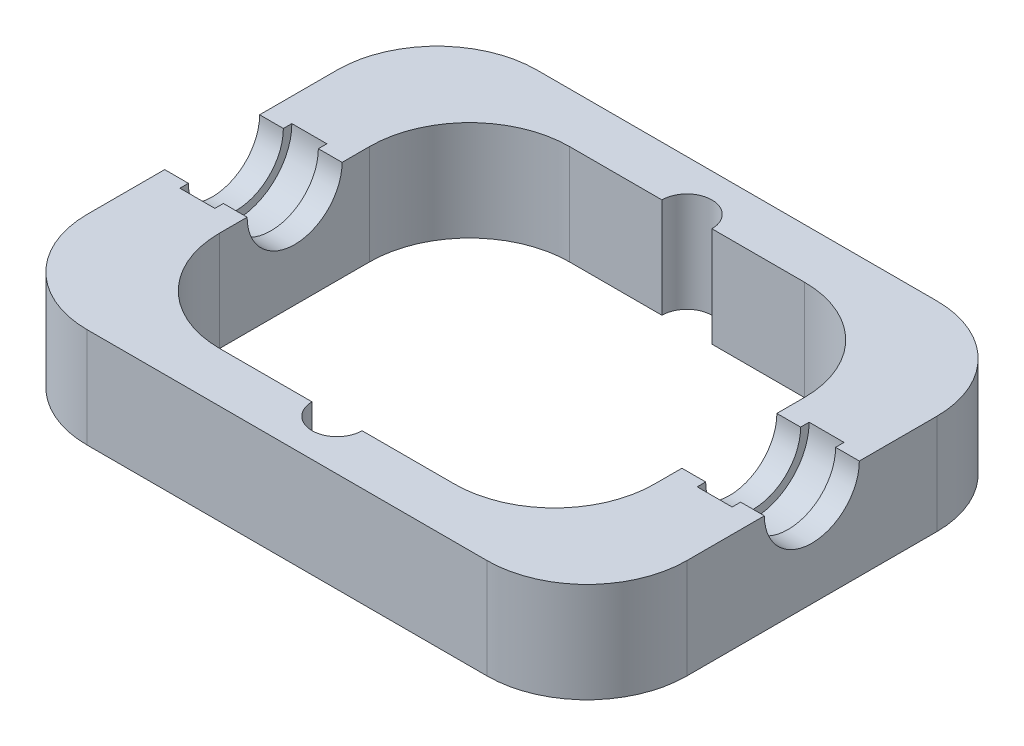
ISO-10303-21;
HEADER;
FILE_DESCRIPTION(('STEP AP214'),'2;1');
FILE_NAME('part.step','',(''),(''),'','','');
FILE_SCHEMA(('AUTOMOTIVE_DESIGN { 1 0 10303 214 1 1 1 1 }'));
ENDSEC;
DATA;
#1=APPLICATION_CONTEXT('core data for automotive mechanical design processes');
#2=APPLICATION_PROTOCOL_DEFINITION('international standard','automotive_design',2000,#1);
#3=PRODUCT_CONTEXT('',#1,'mechanical');
#4=PRODUCT('Part','Part','',(#3));
#5=PRODUCT_RELATED_PRODUCT_CATEGORY('part','',(#4));
#6=PRODUCT_DEFINITION_FORMATION('','',#4);
#7=PRODUCT_DEFINITION_CONTEXT('part definition',#1,'design');
#8=PRODUCT_DEFINITION('design','',#6,#7);
#9=PRODUCT_DEFINITION_SHAPE('','',#8);
#10=(LENGTH_UNIT() NAMED_UNIT(*) SI_UNIT(.MILLI.,.METRE.));
#11=(NAMED_UNIT(*) PLANE_ANGLE_UNIT() SI_UNIT($,.RADIAN.));
#12=(NAMED_UNIT(*) SI_UNIT($,.STERADIAN.) SOLID_ANGLE_UNIT());
#13=UNCERTAINTY_MEASURE_WITH_UNIT(LENGTH_MEASURE(1.E-05),#10,'distance_accuracy_value','');
#14=(GEOMETRIC_REPRESENTATION_CONTEXT(3) GLOBAL_UNCERTAINTY_ASSIGNED_CONTEXT((#13)) GLOBAL_UNIT_ASSIGNED_CONTEXT((#10,
#11,#12)) REPRESENTATION_CONTEXT('',''));
#15=CARTESIAN_POINT('',(0.,0.,0.));
#16=DIRECTION('',(0.,0.,1.));
#17=DIRECTION('',(1.,0.,0.));
#18=AXIS2_PLACEMENT_3D('',#15,#16,#17);
#19=CARTESIAN_POINT('',(43.5,20.,-35.));
#20=DIRECTION('',(0.,0.,1.));
#21=DIRECTION('',(1.,0.,0.));
#22=AXIS2_PLACEMENT_3D('',#19,#20,#21);
#23=PLANE('',#22);
#24=DIRECTION('',(0.,1.,0.));
#25=VECTOR('',#24,1.);
#26=CARTESIAN_POINT('',(4.99999999999999,0.,-35.));
#27=LINE('',#26,#25);
#28=CARTESIAN_POINT('',(4.99999999999999,0.,-35.));
#29=VERTEX_POINT('',#28);
#30=CARTESIAN_POINT('',(4.99999999999999,20.,-35.));
#31=VERTEX_POINT('',#30);
#32=EDGE_CURVE('E11',#29,#31,#27,.T.);
#33=ORIENTED_EDGE('',*,*,#32,.F.);
#34=DIRECTION('',(-1.,0.,0.));
#35=VECTOR('',#34,1.);
#36=CARTESIAN_POINT('',(43.5,0.,-35.));
#37=LINE('',#36,#35);
#38=CARTESIAN_POINT('',(23.5,0.,-35.));
#39=VERTEX_POINT('',#38);
#40=EDGE_CURVE('E280',#39,#29,#37,.T.);
#41=ORIENTED_EDGE('',*,*,#40,.F.);
#42=DIRECTION('',(0.,-1.,0.));
#43=VECTOR('',#42,1.);
#44=CARTESIAN_POINT('',(23.5,20.,-35.));
#45=LINE('',#44,#43);
#46=CARTESIAN_POINT('',(23.5,20.,-35.));
#47=VERTEX_POINT('',#46);
#48=EDGE_CURVE('E258',#39,#47,#45,.F.);
#49=ORIENTED_EDGE('',*,*,#48,.T.);
#50=DIRECTION('',(-1.,0.,0.));
#51=VECTOR('',#50,1.);
#52=CARTESIAN_POINT('',(43.5,20.,-35.));
#53=LINE('',#52,#51);
#54=EDGE_CURVE('E252',#47,#31,#53,.T.);
#55=ORIENTED_EDGE('',*,*,#54,.T.);
#56=EDGE_LOOP('',(#33,#41,#49,#55));
#57=FACE_BOUND('',#56,.T.);
#58=ADVANCED_FACE('F35',(#57),#23,.T.);
#59=CARTESIAN_POINT('',(43.5,20.,35.));
#60=DIRECTION('',(0.,0.,-1.));
#61=DIRECTION('',(-1.,0.,0.));
#62=AXIS2_PLACEMENT_3D('',#59,#60,#61);
#63=PLANE('',#62);
#64=DIRECTION('',(0.,1.,0.));
#65=VECTOR('',#64,1.);
#66=CARTESIAN_POINT('',(-5.00000000000001,0.,35.));
#67=LINE('',#66,#65);
#68=CARTESIAN_POINT('',(-5.00000000000001,0.,35.));
#69=VERTEX_POINT('',#68);
#70=CARTESIAN_POINT('',(-5.00000000000001,20.,35.));
#71=VERTEX_POINT('',#70);
#72=EDGE_CURVE('E406',#69,#71,#67,.T.);
#73=ORIENTED_EDGE('',*,*,#72,.F.);
#74=DIRECTION('',(1.,0.,0.));
#75=VECTOR('',#74,1.);
#76=CARTESIAN_POINT('',(43.5,0.,35.));
#77=LINE('',#76,#75);
#78=CARTESIAN_POINT('',(-23.5,0.,35.));
#79=VERTEX_POINT('',#78);
#80=EDGE_CURVE('E273',#79,#69,#77,.T.);
#81=ORIENTED_EDGE('',*,*,#80,.F.);
#82=DIRECTION('',(0.,-1.,0.));
#83=VECTOR('',#82,1.);
#84=CARTESIAN_POINT('',(-23.5,20.,35.));
#85=LINE('',#84,#83);
#86=CARTESIAN_POINT('',(-23.5,20.,35.));
#87=VERTEX_POINT('',#86);
#88=EDGE_CURVE('E377',#79,#87,#85,.F.);
#89=ORIENTED_EDGE('',*,*,#88,.T.);
#90=DIRECTION('',(1.,0.,0.));
#91=VECTOR('',#90,1.);
#92=CARTESIAN_POINT('',(43.5,20.,35.));
#93=LINE('',#92,#91);
#94=EDGE_CURVE('E437',#87,#71,#93,.T.);
#95=ORIENTED_EDGE('',*,*,#94,.T.);
#96=EDGE_LOOP('',(#73,#81,#89,#95));
#97=FACE_BOUND('',#96,.T.);
#98=ADVANCED_FACE('F434',(#97),#63,.T.);
#99=CARTESIAN_POINT('',(0.,20.,0.));
#100=DIRECTION('',(0.,1.,0.));
#101=DIRECTION('',(0.,0.,1.));
#102=AXIS2_PLACEMENT_3D('',#99,#100,#101);
#103=PLANE('',#102);
#104=CARTESIAN_POINT('',(0.,20.,35.));
#105=DIRECTION('',(0.,1.,0.));
#106=DIRECTION('',(0.,0.,1.));
#107=AXIS2_PLACEMENT_3D('',#104,#105,#106);
#108=CIRCLE('',#107,5.);
#109=CARTESIAN_POINT('',(4.99999999999998,20.,35.));
#110=VERTEX_POINT('',#109);
#111=EDGE_CURVE('E57',#71,#110,#108,.T.);
#112=ORIENTED_EDGE('',*,*,#111,.F.);
#113=ORIENTED_EDGE('',*,*,#94,.F.);
#114=CARTESIAN_POINT('',(-23.5,20.,15.));
#115=DIRECTION('',(0.,1.,0.));
#116=DIRECTION('',(0.,0.,1.));
#117=AXIS2_PLACEMENT_3D('',#114,#115,#116);
#118=CIRCLE('',#117,20.);
#119=CARTESIAN_POINT('',(-43.5,20.,15.));
#120=VERTEX_POINT('',#119);
#121=EDGE_CURVE('E398',#87,#120,#118,.F.);
#122=ORIENTED_EDGE('',*,*,#121,.T.);
#123=DIRECTION('',(0.,0.,1.));
#124=VECTOR('',#123,1.);
#125=CARTESIAN_POINT('',(-43.5,20.,35.));
#126=LINE('',#125,#124);
#127=CARTESIAN_POINT('',(-43.5,20.,9.50000000000002));
#128=VERTEX_POINT('',#127);
#129=EDGE_CURVE('E282',#128,#120,#126,.T.);
#130=ORIENTED_EDGE('',*,*,#129,.F.);
#131=DIRECTION('',(1.,0.,0.));
#132=VECTOR('',#131,1.);
#133=CARTESIAN_POINT('',(-60.,20.,9.50000000000002));
#134=LINE('',#133,#132);
#135=CARTESIAN_POINT('',(-48.25,20.,9.50000000000002));
#136=VERTEX_POINT('',#135);
#137=EDGE_CURVE('E475',#136,#128,#134,.T.);
#138=ORIENTED_EDGE('',*,*,#137,.F.);
#139=DIRECTION('',(0.,0.,-1.));
#140=VECTOR('',#139,1.);
#141=CARTESIAN_POINT('',(-48.25,20.,0.));
#142=LINE('',#141,#140);
#143=CARTESIAN_POINT('',(-48.25,20.,11.2));
#144=VERTEX_POINT('',#143);
#145=EDGE_CURVE('E304',#144,#136,#142,.T.);
#146=ORIENTED_EDGE('',*,*,#145,.F.);
#147=DIRECTION('',(1.,0.,0.));
#148=VECTOR('',#147,1.);
#149=CARTESIAN_POINT('',(55.25,20.,11.2));
#150=LINE('',#149,#148);
#151=CARTESIAN_POINT('',(-55.25,20.,11.2));
#152=VERTEX_POINT('',#151);
#153=EDGE_CURVE('E309',#152,#144,#150,.T.);
#154=ORIENTED_EDGE('',*,*,#153,.F.);
#155=DIRECTION('',(0.,0.,1.));
#156=VECTOR('',#155,1.);
#157=CARTESIAN_POINT('',(-55.25,20.,0.));
#158=LINE('',#157,#156);
#159=CARTESIAN_POINT('',(-55.25,20.,9.50000000000002));
#160=VERTEX_POINT('',#159);
#161=EDGE_CURVE('E312',#160,#152,#158,.T.);
#162=ORIENTED_EDGE('',*,*,#161,.F.);
#163=CARTESIAN_POINT('',(-60.,20.,9.50000000000002));
#164=VERTEX_POINT('',#163);
#165=EDGE_CURVE('E460',#164,#160,#134,.T.);
#166=ORIENTED_EDGE('',*,*,#165,.F.);
#167=DIRECTION('',(0.,0.,1.));
#168=VECTOR('',#167,1.);
#169=CARTESIAN_POINT('',(-60.,20.,45.));
#170=LINE('',#169,#168);
#171=CARTESIAN_POINT('',(-60.,20.,25.));
#172=VERTEX_POINT('',#171);
#173=EDGE_CURVE('E286',#164,#172,#170,.T.);
#174=ORIENTED_EDGE('',*,*,#173,.T.);
#175=CARTESIAN_POINT('',(-40.,20.,25.));
#176=DIRECTION('',(0.,1.,0.));
#177=DIRECTION('',(0.,0.,1.));
#178=AXIS2_PLACEMENT_3D('',#175,#176,#177);
#179=CIRCLE('',#178,20.);
#180=CARTESIAN_POINT('',(-40.,20.,45.));
#181=VERTEX_POINT('',#180);
#182=EDGE_CURVE('E359',#172,#181,#179,.T.);
#183=ORIENTED_EDGE('',*,*,#182,.T.);
#184=DIRECTION('',(1.,0.,0.));
#185=VECTOR('',#184,1.);
#186=CARTESIAN_POINT('',(60.,20.,45.));
#187=LINE('',#186,#185);
#188=CARTESIAN_POINT('',(40.,20.,45.));
#189=VERTEX_POINT('',#188);
#190=EDGE_CURVE('E285',#181,#189,#187,.T.);
#191=ORIENTED_EDGE('',*,*,#190,.T.);
#192=CARTESIAN_POINT('',(40.,20.,25.));
#193=DIRECTION('',(0.,1.,0.));
#194=DIRECTION('',(0.,0.,1.));
#195=AXIS2_PLACEMENT_3D('',#192,#193,#194);
#196=CIRCLE('',#195,20.);
#197=CARTESIAN_POINT('',(60.,20.,25.));
#198=VERTEX_POINT('',#197);
#199=EDGE_CURVE('E361',#189,#198,#196,.T.);
#200=ORIENTED_EDGE('',*,*,#199,.T.);
#201=DIRECTION('',(0.,0.,-1.));
#202=VECTOR('',#201,1.);
#203=CARTESIAN_POINT('',(60.,20.,45.));
#204=LINE('',#203,#202);
#205=CARTESIAN_POINT('',(60.,20.,9.50000000000002));
#206=VERTEX_POINT('',#205);
#207=EDGE_CURVE('E290',#198,#206,#204,.T.);
#208=ORIENTED_EDGE('',*,*,#207,.T.);
#209=CARTESIAN_POINT('',(55.25,20.,9.50000000000002));
#210=VERTEX_POINT('',#209);
#211=EDGE_CURVE('E454',#210,#206,#134,.T.);
#212=ORIENTED_EDGE('',*,*,#211,.F.);
#213=DIRECTION('',(0.,0.,-1.));
#214=VECTOR('',#213,1.);
#215=CARTESIAN_POINT('',(55.25,20.,0.));
#216=LINE('',#215,#214);
#217=CARTESIAN_POINT('',(55.25,20.,11.2));
#218=VERTEX_POINT('',#217);
#219=EDGE_CURVE('E317',#218,#210,#216,.T.);
#220=ORIENTED_EDGE('',*,*,#219,.F.);
#221=DIRECTION('',(1.,0.,0.));
#222=VECTOR('',#221,1.);
#223=CARTESIAN_POINT('',(55.25,20.,11.2));
#224=LINE('',#223,#222);
#225=CARTESIAN_POINT('',(48.25,20.,11.2));
#226=VERTEX_POINT('',#225);
#227=EDGE_CURVE('E322',#226,#218,#224,.T.);
#228=ORIENTED_EDGE('',*,*,#227,.F.);
#229=DIRECTION('',(0.,0.,1.));
#230=VECTOR('',#229,1.);
#231=CARTESIAN_POINT('',(48.25,20.,0.));
#232=LINE('',#231,#230);
#233=CARTESIAN_POINT('',(48.25,20.,9.50000000000002));
#234=VERTEX_POINT('',#233);
#235=EDGE_CURVE('E325',#234,#226,#232,.T.);
#236=ORIENTED_EDGE('',*,*,#235,.F.);
#237=CARTESIAN_POINT('',(43.5,20.,9.50000000000002));
#238=VERTEX_POINT('',#237);
#239=EDGE_CURVE('E461',#238,#234,#134,.T.);
#240=ORIENTED_EDGE('',*,*,#239,.F.);
#241=DIRECTION('',(0.,0.,-1.));
#242=VECTOR('',#241,1.);
#243=CARTESIAN_POINT('',(43.5,20.,35.));
#244=LINE('',#243,#242);
#245=CARTESIAN_POINT('',(43.5,20.,15.));
#246=VERTEX_POINT('',#245);
#247=EDGE_CURVE('E264',#246,#238,#244,.T.);
#248=ORIENTED_EDGE('',*,*,#247,.F.);
#249=CARTESIAN_POINT('',(23.5,20.,15.));
#250=DIRECTION('',(0.,1.,0.));
#251=DIRECTION('',(0.,0.,1.));
#252=AXIS2_PLACEMENT_3D('',#249,#250,#251);
#253=CIRCLE('',#252,20.);
#254=CARTESIAN_POINT('',(23.5,20.,35.));
#255=VERTEX_POINT('',#254);
#256=EDGE_CURVE('E393',#246,#255,#253,.F.);
#257=ORIENTED_EDGE('',*,*,#256,.T.);
#258=EDGE_CURVE('E443',#110,#255,#93,.T.);
#259=ORIENTED_EDGE('',*,*,#258,.F.);
#260=EDGE_LOOP('',(#112,#113,#122,#130,#138,#146,#154,#162,#166,#174,#183,#191,#200,#208,#212,
#220,#228,#236,#240,#248,#257,#259));
#261=FACE_BOUND('',#260,.T.);
#262=ADVANCED_FACE('F442',(#261),#103,.T.);
#263=CARTESIAN_POINT('',(0.,20.,-35.));
#264=DIRECTION('',(0.,1.,0.));
#265=DIRECTION('',(0.,0.,1.));
#266=AXIS2_PLACEMENT_3D('',#263,#264,#265);
#267=CIRCLE('',#266,5.);
#268=CARTESIAN_POINT('',(-5.00000000000001,20.,-35.));
#269=VERTEX_POINT('',#268);
#270=EDGE_CURVE('E49',#31,#269,#267,.T.);
#271=ORIENTED_EDGE('',*,*,#270,.F.);
#272=ORIENTED_EDGE('',*,*,#54,.F.);
#273=CARTESIAN_POINT('',(23.5,20.,-15.));
#274=DIRECTION('',(0.,1.,0.));
#275=DIRECTION('',(0.,0.,1.));
#276=AXIS2_PLACEMENT_3D('',#273,#274,#275);
#277=CIRCLE('',#276,20.);
#278=CARTESIAN_POINT('',(43.5,20.,-15.));
#279=VERTEX_POINT('',#278);
#280=EDGE_CURVE('E389',#47,#279,#277,.F.);
#281=ORIENTED_EDGE('',*,*,#280,.T.);
#282=CARTESIAN_POINT('',(43.5,20.,-9.49999999999998));
#283=VERTEX_POINT('',#282);
#284=EDGE_CURVE('E490',#283,#279,#244,.T.);
#285=ORIENTED_EDGE('',*,*,#284,.F.);
#286=DIRECTION('',(1.,0.,0.));
#287=VECTOR('',#286,1.);
#288=CARTESIAN_POINT('',(-60.,20.,-9.49999999999998));
#289=LINE('',#288,#287);
#290=CARTESIAN_POINT('',(48.25,20.,-9.49999999999998));
#291=VERTEX_POINT('',#290);
#292=EDGE_CURVE('E456',#291,#283,#289,.F.);
#293=ORIENTED_EDGE('',*,*,#292,.F.);
#294=CARTESIAN_POINT('',(48.25,20.,-11.2));
#295=VERTEX_POINT('',#294);
#296=EDGE_CURVE('E326',#295,#291,#232,.T.);
#297=ORIENTED_EDGE('',*,*,#296,.F.);
#298=DIRECTION('',(1.,0.,0.));
#299=VECTOR('',#298,1.);
#300=CARTESIAN_POINT('',(55.25,20.,-11.2));
#301=LINE('',#300,#299);
#302=CARTESIAN_POINT('',(55.25,20.,-11.2));
#303=VERTEX_POINT('',#302);
#304=EDGE_CURVE('E320',#303,#295,#301,.F.);
#305=ORIENTED_EDGE('',*,*,#304,.F.);
#306=CARTESIAN_POINT('',(55.25,20.,-9.49999999999998));
#307=VERTEX_POINT('',#306);
#308=EDGE_CURVE('E316',#307,#303,#216,.T.);
#309=ORIENTED_EDGE('',*,*,#308,.F.);
#310=CARTESIAN_POINT('',(60.,20.,-9.49999999999998));
#311=VERTEX_POINT('',#310);
#312=EDGE_CURVE('E451',#311,#307,#289,.F.);
#313=ORIENTED_EDGE('',*,*,#312,.F.);
#314=CARTESIAN_POINT('',(60.,20.,-25.));
#315=VERTEX_POINT('',#314);
#316=EDGE_CURVE('E289',#311,#315,#204,.T.);
#317=ORIENTED_EDGE('',*,*,#316,.T.);
#318=CARTESIAN_POINT('',(40.,20.,-25.));
#319=DIRECTION('',(0.,1.,0.));
#320=DIRECTION('',(0.,0.,1.));
#321=AXIS2_PLACEMENT_3D('',#318,#319,#320);
#322=CIRCLE('',#321,20.);
#323=CARTESIAN_POINT('',(40.,20.,-45.));
#324=VERTEX_POINT('',#323);
#325=EDGE_CURVE('E352',#315,#324,#322,.T.);
#326=ORIENTED_EDGE('',*,*,#325,.T.);
#327=DIRECTION('',(-1.,0.,0.));
#328=VECTOR('',#327,1.);
#329=CARTESIAN_POINT('',(60.,20.,-45.));
#330=LINE('',#329,#328);
#331=CARTESIAN_POINT('',(-40.,20.,-45.));
#332=VERTEX_POINT('',#331);
#333=EDGE_CURVE('E292',#324,#332,#330,.T.);
#334=ORIENTED_EDGE('',*,*,#333,.T.);
#335=CARTESIAN_POINT('',(-40.,20.,-25.));
#336=DIRECTION('',(0.,1.,0.));
#337=DIRECTION('',(0.,0.,1.));
#338=AXIS2_PLACEMENT_3D('',#335,#336,#337);
#339=CIRCLE('',#338,20.);
#340=CARTESIAN_POINT('',(-60.,20.,-25.));
#341=VERTEX_POINT('',#340);
#342=EDGE_CURVE('E350',#332,#341,#339,.T.);
#343=ORIENTED_EDGE('',*,*,#342,.T.);
#344=CARTESIAN_POINT('',(-60.,20.,-9.49999999999998));
#345=VERTEX_POINT('',#344);
#346=EDGE_CURVE('E283',#341,#345,#170,.T.);
#347=ORIENTED_EDGE('',*,*,#346,.T.);
#348=CARTESIAN_POINT('',(-55.25,20.,-9.49999999999998));
#349=VERTEX_POINT('',#348);
#350=EDGE_CURVE('E455',#349,#345,#289,.F.);
#351=ORIENTED_EDGE('',*,*,#350,.F.);
#352=CARTESIAN_POINT('',(-55.25,20.,-11.2));
#353=VERTEX_POINT('',#352);
#354=EDGE_CURVE('E313',#353,#349,#158,.T.);
#355=ORIENTED_EDGE('',*,*,#354,.F.);
#356=DIRECTION('',(1.,0.,0.));
#357=VECTOR('',#356,1.);
#358=CARTESIAN_POINT('',(55.25,20.,-11.2));
#359=LINE('',#358,#357);
#360=CARTESIAN_POINT('',(-48.25,20.,-11.2));
#361=VERTEX_POINT('',#360);
#362=EDGE_CURVE('E307',#361,#353,#359,.F.);
#363=ORIENTED_EDGE('',*,*,#362,.F.);
#364=CARTESIAN_POINT('',(-48.25,20.,-9.49999999999998));
#365=VERTEX_POINT('',#364);
#366=EDGE_CURVE('E294',#365,#361,#142,.T.);
#367=ORIENTED_EDGE('',*,*,#366,.F.);
#368=CARTESIAN_POINT('',(-43.5,20.,-9.49999999999998));
#369=VERTEX_POINT('',#368);
#370=EDGE_CURVE('E470',#369,#365,#289,.F.);
#371=ORIENTED_EDGE('',*,*,#370,.F.);
#372=CARTESIAN_POINT('',(-43.5,20.,-15.));
#373=VERTEX_POINT('',#372);
#374=EDGE_CURVE('E489',#373,#369,#126,.T.);
#375=ORIENTED_EDGE('',*,*,#374,.F.);
#376=CARTESIAN_POINT('',(-23.5,20.,-15.));
#377=DIRECTION('',(0.,1.,0.));
#378=DIRECTION('',(0.,0.,1.));
#379=AXIS2_PLACEMENT_3D('',#376,#377,#378);
#380=CIRCLE('',#379,20.);
#381=CARTESIAN_POINT('',(-23.5,20.,-35.));
#382=VERTEX_POINT('',#381);
#383=EDGE_CURVE('E402',#373,#382,#380,.F.);
#384=ORIENTED_EDGE('',*,*,#383,.T.);
#385=EDGE_CURVE('E255',#269,#382,#53,.T.);
#386=ORIENTED_EDGE('',*,*,#385,.F.);
#387=EDGE_LOOP('',(#271,#272,#281,#285,#293,#297,#305,#309,#313,#317,#326,#334,#343,#347,#351,
#355,#363,#367,#371,#375,#384,#386));
#388=FACE_BOUND('',#387,.T.);
#389=ADVANCED_FACE('F251',(#388),#103,.T.);
#390=CARTESIAN_POINT('',(0.,0.,0.));
#391=DIRECTION('',(0.,1.,0.));
#392=DIRECTION('',(0.,0.,1.));
#393=AXIS2_PLACEMENT_3D('',#390,#391,#392);
#394=PLANE('',#393);
#395=DIRECTION('',(-1.,0.,0.));
#396=VECTOR('',#395,1.);
#397=CARTESIAN_POINT('',(60.,0.,-45.));
#398=LINE('',#397,#396);
#399=CARTESIAN_POINT('',(40.,0.,-45.));
#400=VERTEX_POINT('',#399);
#401=CARTESIAN_POINT('',(-40.,0.,-45.));
#402=VERTEX_POINT('',#401);
#403=EDGE_CURVE('E301',#400,#402,#398,.T.);
#404=ORIENTED_EDGE('',*,*,#403,.F.);
#405=CARTESIAN_POINT('',(40.,0.,-25.));
#406=DIRECTION('',(0.,1.,0.));
#407=DIRECTION('',(0.,0.,1.));
#408=AXIS2_PLACEMENT_3D('',#405,#406,#407);
#409=CIRCLE('',#408,20.);
#410=CARTESIAN_POINT('',(60.,0.,-25.));
#411=VERTEX_POINT('',#410);
#412=EDGE_CURVE('E343',#400,#411,#409,.F.);
#413=ORIENTED_EDGE('',*,*,#412,.T.);
#414=DIRECTION('',(0.,0.,-1.));
#415=VECTOR('',#414,1.);
#416=CARTESIAN_POINT('',(60.,0.,45.));
#417=LINE('',#416,#415);
#418=CARTESIAN_POINT('',(60.,0.,25.));
#419=VERTEX_POINT('',#418);
#420=EDGE_CURVE('E298',#419,#411,#417,.T.);
#421=ORIENTED_EDGE('',*,*,#420,.F.);
#422=CARTESIAN_POINT('',(40.,0.,25.));
#423=DIRECTION('',(0.,1.,0.));
#424=DIRECTION('',(0.,0.,1.));
#425=AXIS2_PLACEMENT_3D('',#422,#423,#424);
#426=CIRCLE('',#425,20.);
#427=CARTESIAN_POINT('',(40.,0.,45.));
#428=VERTEX_POINT('',#427);
#429=EDGE_CURVE('E341',#419,#428,#426,.F.);
#430=ORIENTED_EDGE('',*,*,#429,.T.);
#431=DIRECTION('',(1.,0.,0.));
#432=VECTOR('',#431,1.);
#433=CARTESIAN_POINT('',(60.,0.,45.));
#434=LINE('',#433,#432);
#435=CARTESIAN_POINT('',(-40.,0.,45.));
#436=VERTEX_POINT('',#435);
#437=EDGE_CURVE('E262',#436,#428,#434,.T.);
#438=ORIENTED_EDGE('',*,*,#437,.F.);
#439=CARTESIAN_POINT('',(-40.,0.,25.));
#440=DIRECTION('',(0.,1.,0.));
#441=DIRECTION('',(0.,0.,1.));
#442=AXIS2_PLACEMENT_3D('',#439,#440,#441);
#443=CIRCLE('',#442,20.);
#444=CARTESIAN_POINT('',(-60.,0.,25.));
#445=VERTEX_POINT('',#444);
#446=EDGE_CURVE('E337',#436,#445,#443,.F.);
#447=ORIENTED_EDGE('',*,*,#446,.T.);
#448=DIRECTION('',(0.,0.,1.));
#449=VECTOR('',#448,1.);
#450=CARTESIAN_POINT('',(-60.,0.,45.));
#451=LINE('',#450,#449);
#452=CARTESIAN_POINT('',(-60.,0.,-25.));
#453=VERTEX_POINT('',#452);
#454=EDGE_CURVE('E259',#453,#445,#451,.T.);
#455=ORIENTED_EDGE('',*,*,#454,.F.);
#456=CARTESIAN_POINT('',(-40.,0.,-25.));
#457=DIRECTION('',(0.,1.,0.));
#458=DIRECTION('',(0.,0.,1.));
#459=AXIS2_PLACEMENT_3D('',#456,#457,#458);
#460=CIRCLE('',#459,20.);
#461=EDGE_CURVE('E339',#453,#402,#460,.F.);
#462=ORIENTED_EDGE('',*,*,#461,.T.);
#463=EDGE_LOOP('',(#404,#413,#421,#430,#438,#447,#455,#462));
#464=FACE_BOUND('',#463,.T.);
#465=ORIENTED_EDGE('',*,*,#40,.T.);
#466=CARTESIAN_POINT('',(0.,0.,-35.));
#467=DIRECTION('',(0.,1.,0.));
#468=DIRECTION('',(0.,0.,1.));
#469=AXIS2_PLACEMENT_3D('',#466,#467,#468);
#470=CIRCLE('',#469,5.);
#471=CARTESIAN_POINT('',(-5.00000000000001,0.,-35.));
#472=VERTEX_POINT('',#471);
#473=EDGE_CURVE('E243',#29,#472,#470,.T.);
#474=ORIENTED_EDGE('',*,*,#473,.T.);
#475=CARTESIAN_POINT('',(-23.5,0.,-35.));
#476=VERTEX_POINT('',#475);
#477=EDGE_CURVE('E279',#472,#476,#37,.T.);
#478=ORIENTED_EDGE('',*,*,#477,.T.);
#479=CARTESIAN_POINT('',(-23.5,0.,-15.));
#480=DIRECTION('',(0.,1.,0.));
#481=DIRECTION('',(0.,0.,1.));
#482=AXIS2_PLACEMENT_3D('',#479,#480,#481);
#483=CIRCLE('',#482,20.);
#484=CARTESIAN_POINT('',(-43.5,0.,-15.));
#485=VERTEX_POINT('',#484);
#486=EDGE_CURVE('E400',#476,#485,#483,.T.);
#487=ORIENTED_EDGE('',*,*,#486,.T.);
#488=DIRECTION('',(0.,0.,1.));
#489=VECTOR('',#488,1.);
#490=CARTESIAN_POINT('',(-43.5,0.,35.));
#491=LINE('',#490,#489);
#492=CARTESIAN_POINT('',(-43.5,0.,15.));
#493=VERTEX_POINT('',#492);
#494=EDGE_CURVE('E268',#485,#493,#491,.T.);
#495=ORIENTED_EDGE('',*,*,#494,.T.);
#496=CARTESIAN_POINT('',(-23.5,0.,15.));
#497=DIRECTION('',(0.,1.,0.));
#498=DIRECTION('',(0.,0.,1.));
#499=AXIS2_PLACEMENT_3D('',#496,#497,#498);
#500=CIRCLE('',#499,20.);
#501=EDGE_CURVE('E396',#493,#79,#500,.T.);
#502=ORIENTED_EDGE('',*,*,#501,.T.);
#503=ORIENTED_EDGE('',*,*,#80,.T.);
#504=CARTESIAN_POINT('',(0.,0.,35.));
#505=DIRECTION('',(0.,1.,0.));
#506=DIRECTION('',(0.,0.,1.));
#507=AXIS2_PLACEMENT_3D('',#504,#505,#506);
#508=CIRCLE('',#507,5.);
#509=CARTESIAN_POINT('',(4.99999999999999,0.,35.));
#510=VERTEX_POINT('',#509);
#511=EDGE_CURVE('E439',#69,#510,#508,.T.);
#512=ORIENTED_EDGE('',*,*,#511,.T.);
#513=CARTESIAN_POINT('',(23.5,0.,35.));
#514=VERTEX_POINT('',#513);
#515=EDGE_CURVE('E271',#510,#514,#77,.T.);
#516=ORIENTED_EDGE('',*,*,#515,.T.);
#517=CARTESIAN_POINT('',(23.5,0.,15.));
#518=DIRECTION('',(0.,1.,0.));
#519=DIRECTION('',(0.,0.,1.));
#520=AXIS2_PLACEMENT_3D('',#517,#518,#519);
#521=CIRCLE('',#520,20.);
#522=CARTESIAN_POINT('',(43.5,0.,15.));
#523=VERTEX_POINT('',#522);
#524=EDGE_CURVE('E391',#514,#523,#521,.T.);
#525=ORIENTED_EDGE('',*,*,#524,.T.);
#526=DIRECTION('',(0.,0.,-1.));
#527=VECTOR('',#526,1.);
#528=CARTESIAN_POINT('',(43.5,0.,35.));
#529=LINE('',#528,#527);
#530=CARTESIAN_POINT('',(43.5,0.,-15.));
#531=VERTEX_POINT('',#530);
#532=EDGE_CURVE('E276',#523,#531,#529,.T.);
#533=ORIENTED_EDGE('',*,*,#532,.T.);
#534=CARTESIAN_POINT('',(23.5,0.,-15.));
#535=DIRECTION('',(0.,1.,0.));
#536=DIRECTION('',(0.,0.,1.));
#537=AXIS2_PLACEMENT_3D('',#534,#535,#536);
#538=CIRCLE('',#537,20.);
#539=EDGE_CURVE('E387',#531,#39,#538,.T.);
#540=ORIENTED_EDGE('',*,*,#539,.T.);
#541=EDGE_LOOP('',(#465,#474,#478,#487,#495,#502,#503,#512,#516,#525,#533,#540));
#542=FACE_BOUND('',#541,.T.);
#543=ADVANCED_FACE('F410',(#464,#542),#394,.F.);
#544=CARTESIAN_POINT('',(-60.,20.,45.));
#545=DIRECTION('',(1.,0.,0.));
#546=DIRECTION('',(0.,0.,-1.));
#547=AXIS2_PLACEMENT_3D('',#544,#545,#546);
#548=PLANE('',#547);
#549=ORIENTED_EDGE('',*,*,#346,.F.);
#550=DIRECTION('',(0.,-1.,0.));
#551=VECTOR('',#550,1.);
#552=CARTESIAN_POINT('',(-60.,20.,-25.));
#553=LINE('',#552,#551);
#554=EDGE_CURVE('E365',#341,#453,#553,.T.);
#555=ORIENTED_EDGE('',*,*,#554,.T.);
#556=ORIENTED_EDGE('',*,*,#454,.T.);
#557=DIRECTION('',(0.,-1.,0.));
#558=VECTOR('',#557,1.);
#559=CARTESIAN_POINT('',(-60.,20.,25.));
#560=LINE('',#559,#558);
#561=EDGE_CURVE('E363',#445,#172,#560,.F.);
#562=ORIENTED_EDGE('',*,*,#561,.T.);
#563=ORIENTED_EDGE('',*,*,#173,.F.);
#564=CARTESIAN_POINT('',(-60.,20.,0.));
#565=DIRECTION('',(1.,0.,0.));
#566=DIRECTION('',(0.,0.,-1.));
#567=AXIS2_PLACEMENT_3D('',#564,#565,#566);
#568=CIRCLE('',#567,9.5);
#569=EDGE_CURVE('E448',#164,#345,#568,.T.);
#570=ORIENTED_EDGE('',*,*,#569,.T.);
#571=EDGE_LOOP('',(#549,#555,#556,#562,#563,#570));
#572=FACE_BOUND('',#571,.T.);
#573=ADVANCED_FACE('F554',(#572),#548,.F.);
#574=CARTESIAN_POINT('',(60.,20.,45.));
#575=DIRECTION('',(0.,0.,-1.));
#576=DIRECTION('',(-1.,0.,0.));
#577=AXIS2_PLACEMENT_3D('',#574,#575,#576);
#578=PLANE('',#577);
#579=ORIENTED_EDGE('',*,*,#437,.T.);
#580=DIRECTION('',(0.,-1.,0.));
#581=VECTOR('',#580,1.);
#582=CARTESIAN_POINT('',(40.,20.,45.));
#583=LINE('',#582,#581);
#584=EDGE_CURVE('E357',#428,#189,#583,.F.);
#585=ORIENTED_EDGE('',*,*,#584,.T.);
#586=ORIENTED_EDGE('',*,*,#190,.F.);
#587=DIRECTION('',(0.,-1.,0.));
#588=VECTOR('',#587,1.);
#589=CARTESIAN_POINT('',(-40.,20.,45.));
#590=LINE('',#589,#588);
#591=EDGE_CURVE('E354',#181,#436,#590,.T.);
#592=ORIENTED_EDGE('',*,*,#591,.T.);
#593=EDGE_LOOP('',(#579,#585,#586,#592));
#594=FACE_BOUND('',#593,.T.);
#595=ADVANCED_FACE('F608',(#594),#578,.F.);
#596=CARTESIAN_POINT('',(60.,20.,45.));
#597=DIRECTION('',(-1.,0.,0.));
#598=DIRECTION('',(0.,0.,1.));
#599=AXIS2_PLACEMENT_3D('',#596,#597,#598);
#600=PLANE('',#599);
#601=ORIENTED_EDGE('',*,*,#420,.T.);
#602=DIRECTION('',(0.,-1.,0.));
#603=VECTOR('',#602,1.);
#604=CARTESIAN_POINT('',(60.,20.,-25.));
#605=LINE('',#604,#603);
#606=EDGE_CURVE('E348',#411,#315,#605,.F.);
#607=ORIENTED_EDGE('',*,*,#606,.T.);
#608=ORIENTED_EDGE('',*,*,#316,.F.);
#609=CARTESIAN_POINT('',(60.,20.,0.));
#610=DIRECTION('',(1.,0.,0.));
#611=DIRECTION('',(0.,0.,-1.));
#612=AXIS2_PLACEMENT_3D('',#609,#610,#611);
#613=CIRCLE('',#612,9.5);
#614=EDGE_CURVE('E445',#206,#311,#613,.T.);
#615=ORIENTED_EDGE('',*,*,#614,.F.);
#616=ORIENTED_EDGE('',*,*,#207,.F.);
#617=DIRECTION('',(0.,-1.,0.));
#618=VECTOR('',#617,1.);
#619=CARTESIAN_POINT('',(60.,20.,25.));
#620=LINE('',#619,#618);
#621=EDGE_CURVE('E345',#198,#419,#620,.T.);
#622=ORIENTED_EDGE('',*,*,#621,.T.);
#623=EDGE_LOOP('',(#601,#607,#608,#615,#616,#622));
#624=FACE_BOUND('',#623,.T.);
#625=ADVANCED_FACE('F534',(#624),#600,.F.);
#626=CARTESIAN_POINT('',(60.,20.,-45.));
#627=DIRECTION('',(0.,0.,1.));
#628=DIRECTION('',(1.,0.,0.));
#629=AXIS2_PLACEMENT_3D('',#626,#627,#628);
#630=PLANE('',#629);
#631=ORIENTED_EDGE('',*,*,#333,.F.);
#632=DIRECTION('',(0.,-1.,0.));
#633=VECTOR('',#632,1.);
#634=CARTESIAN_POINT('',(40.,20.,-45.));
#635=LINE('',#634,#633);
#636=EDGE_CURVE('E334',#324,#400,#635,.T.);
#637=ORIENTED_EDGE('',*,*,#636,.T.);
#638=ORIENTED_EDGE('',*,*,#403,.T.);
#639=DIRECTION('',(0.,-1.,0.));
#640=VECTOR('',#639,1.);
#641=CARTESIAN_POINT('',(-40.,20.,-45.));
#642=LINE('',#641,#640);
#643=EDGE_CURVE('E332',#402,#332,#642,.F.);
#644=ORIENTED_EDGE('',*,*,#643,.T.);
#645=EDGE_LOOP('',(#631,#637,#638,#644));
#646=FACE_BOUND('',#645,.T.);
#647=ADVANCED_FACE('F544',(#646),#630,.F.);
#648=CARTESIAN_POINT('',(-43.5,20.,35.));
#649=DIRECTION('',(1.,0.,0.));
#650=DIRECTION('',(0.,0.,-1.));
#651=AXIS2_PLACEMENT_3D('',#648,#649,#650);
#652=PLANE('',#651);
#653=ORIENTED_EDGE('',*,*,#129,.T.);
#654=DIRECTION('',(0.,-1.,0.));
#655=VECTOR('',#654,1.);
#656=CARTESIAN_POINT('',(-43.5,0.,15.));
#657=LINE('',#656,#655);
#658=EDGE_CURVE('E384',#120,#493,#657,.T.);
#659=ORIENTED_EDGE('',*,*,#658,.T.);
#660=ORIENTED_EDGE('',*,*,#494,.F.);
#661=DIRECTION('',(0.,-1.,0.));
#662=VECTOR('',#661,1.);
#663=CARTESIAN_POINT('',(-43.5,20.,-15.));
#664=LINE('',#663,#662);
#665=EDGE_CURVE('E382',#485,#373,#664,.F.);
#666=ORIENTED_EDGE('',*,*,#665,.T.);
#667=ORIENTED_EDGE('',*,*,#374,.T.);
#668=CARTESIAN_POINT('',(-43.5,20.,0.));
#669=DIRECTION('',(1.,0.,0.));
#670=DIRECTION('',(0.,0.,-1.));
#671=AXIS2_PLACEMENT_3D('',#668,#669,#670);
#672=CIRCLE('',#671,9.5);
#673=EDGE_CURVE('E471',#128,#369,#672,.T.);
#674=ORIENTED_EDGE('',*,*,#673,.F.);
#675=EDGE_LOOP('',(#653,#659,#660,#666,#667,#674));
#676=FACE_BOUND('',#675,.T.);
#677=ADVANCED_FACE('F421',(#676),#652,.T.);
#678=DIRECTION('',(0.,1.,0.));
#679=VECTOR('',#678,1.);
#680=CARTESIAN_POINT('',(4.99999999999999,0.,35.));
#681=LINE('',#680,#679);
#682=EDGE_CURVE('E404',#110,#510,#681,.F.);
#683=ORIENTED_EDGE('',*,*,#682,.F.);
#684=ORIENTED_EDGE('',*,*,#258,.T.);
#685=DIRECTION('',(0.,-1.,0.));
#686=VECTOR('',#685,1.);
#687=CARTESIAN_POINT('',(23.5,0.,35.));
#688=LINE('',#687,#686);
#689=EDGE_CURVE('E379',#255,#514,#688,.T.);
#690=ORIENTED_EDGE('',*,*,#689,.T.);
#691=ORIENTED_EDGE('',*,*,#515,.F.);
#692=EDGE_LOOP('',(#683,#684,#690,#691));
#693=FACE_BOUND('',#692,.T.);
#694=ADVANCED_FACE('F493',(#693),#63,.T.);
#695=CARTESIAN_POINT('',(43.5,20.,35.));
#696=DIRECTION('',(-1.,0.,0.));
#697=DIRECTION('',(0.,0.,1.));
#698=AXIS2_PLACEMENT_3D('',#695,#696,#697);
#699=PLANE('',#698);
#700=ORIENTED_EDGE('',*,*,#284,.T.);
#701=DIRECTION('',(0.,-1.,0.));
#702=VECTOR('',#701,1.);
#703=CARTESIAN_POINT('',(43.5,0.,-15.));
#704=LINE('',#703,#702);
#705=EDGE_CURVE('E370',#279,#531,#704,.T.);
#706=ORIENTED_EDGE('',*,*,#705,.T.);
#707=ORIENTED_EDGE('',*,*,#532,.F.);
#708=DIRECTION('',(0.,-1.,0.));
#709=VECTOR('',#708,1.);
#710=CARTESIAN_POINT('',(43.5,20.,15.));
#711=LINE('',#710,#709);
#712=EDGE_CURVE('E368',#523,#246,#711,.F.);
#713=ORIENTED_EDGE('',*,*,#712,.T.);
#714=ORIENTED_EDGE('',*,*,#247,.T.);
#715=CARTESIAN_POINT('',(43.5,20.,0.));
#716=DIRECTION('',(-1.,0.,0.));
#717=DIRECTION('',(0.,0.,1.));
#718=AXIS2_PLACEMENT_3D('',#715,#716,#717);
#719=CIRCLE('',#718,9.5);
#720=EDGE_CURVE('E464',#283,#238,#719,.T.);
#721=ORIENTED_EDGE('',*,*,#720,.F.);
#722=EDGE_LOOP('',(#700,#706,#707,#713,#714,#721));
#723=FACE_BOUND('',#722,.T.);
#724=ADVANCED_FACE('F505',(#723),#699,.T.);
#725=DIRECTION('',(0.,1.,0.));
#726=VECTOR('',#725,1.);
#727=CARTESIAN_POINT('',(-5.00000000000001,0.,-35.));
#728=LINE('',#727,#726);
#729=EDGE_CURVE('E43',#269,#472,#728,.F.);
#730=ORIENTED_EDGE('',*,*,#729,.F.);
#731=ORIENTED_EDGE('',*,*,#385,.T.);
#732=DIRECTION('',(0.,-1.,0.));
#733=VECTOR('',#732,1.);
#734=CARTESIAN_POINT('',(-23.5,0.,-35.));
#735=LINE('',#734,#733);
#736=EDGE_CURVE('E373',#382,#476,#735,.T.);
#737=ORIENTED_EDGE('',*,*,#736,.T.);
#738=ORIENTED_EDGE('',*,*,#477,.F.);
#739=EDGE_LOOP('',(#730,#731,#737,#738));
#740=FACE_BOUND('',#739,.T.);
#741=ADVANCED_FACE('F413',(#740),#23,.T.);
#742=CARTESIAN_POINT('',(-55.25,20.,-11.2));
#743=DIRECTION('',(-1.,0.,0.));
#744=DIRECTION('',(0.,0.,1.));
#745=AXIS2_PLACEMENT_3D('',#742,#743,#744);
#746=PLANE('',#745);
#747=ORIENTED_EDGE('',*,*,#354,.T.);
#748=CARTESIAN_POINT('',(-55.25,20.,0.));
#749=DIRECTION('',(-1.,0.,0.));
#750=DIRECTION('',(0.,0.,1.));
#751=AXIS2_PLACEMENT_3D('',#748,#749,#750);
#752=CIRCLE('',#751,9.5);
#753=EDGE_CURVE('E474',#349,#160,#752,.T.);
#754=ORIENTED_EDGE('',*,*,#753,.T.);
#755=ORIENTED_EDGE('',*,*,#161,.T.);
#756=CARTESIAN_POINT('',(-55.25,20.,0.));
#757=DIRECTION('',(1.,0.,0.));
#758=DIRECTION('',(0.,0.,-1.));
#759=AXIS2_PLACEMENT_3D('',#756,#757,#758);
#760=CIRCLE('',#759,11.2);
#761=EDGE_CURVE('E272',#152,#353,#760,.T.);
#762=ORIENTED_EDGE('',*,*,#761,.T.);
#763=EDGE_LOOP('',(#747,#754,#755,#762));
#764=FACE_BOUND('',#763,.T.);
#765=ADVANCED_FACE('F586',(#764),#746,.F.);
#766=CARTESIAN_POINT('',(55.25,20.,0.));
#767=DIRECTION('',(1.,0.,0.));
#768=DIRECTION('',(0.,0.,-1.));
#769=AXIS2_PLACEMENT_3D('',#766,#767,#768);
#770=CYLINDRICAL_SURFACE('',#769,11.2);
#771=ORIENTED_EDGE('',*,*,#153,.T.);
#772=CARTESIAN_POINT('',(-48.25,20.,0.));
#773=DIRECTION('',(1.,0.,0.));
#774=DIRECTION('',(0.,0.,-1.));
#775=AXIS2_PLACEMENT_3D('',#772,#773,#774);
#776=CIRCLE('',#775,11.2);
#777=EDGE_CURVE('E484',#144,#361,#776,.T.);
#778=ORIENTED_EDGE('',*,*,#777,.T.);
#779=ORIENTED_EDGE('',*,*,#362,.T.);
#780=ORIENTED_EDGE('',*,*,#761,.F.);
#781=EDGE_LOOP('',(#771,#778,#779,#780));
#782=FACE_BOUND('',#781,.T.);
#783=ADVANCED_FACE('F591',(#782),#770,.F.);
#784=CARTESIAN_POINT('',(-48.25,20.,-11.2));
#785=DIRECTION('',(1.,0.,0.));
#786=DIRECTION('',(0.,0.,-1.));
#787=AXIS2_PLACEMENT_3D('',#784,#785,#786);
#788=PLANE('',#787);
#789=ORIENTED_EDGE('',*,*,#145,.T.);
#790=CARTESIAN_POINT('',(-48.25,20.,0.));
#791=DIRECTION('',(1.,0.,0.));
#792=DIRECTION('',(0.,0.,-1.));
#793=AXIS2_PLACEMENT_3D('',#790,#791,#792);
#794=CIRCLE('',#793,9.5);
#795=EDGE_CURVE('E467',#136,#365,#794,.T.);
#796=ORIENTED_EDGE('',*,*,#795,.T.);
#797=ORIENTED_EDGE('',*,*,#366,.T.);
#798=ORIENTED_EDGE('',*,*,#777,.F.);
#799=EDGE_LOOP('',(#789,#796,#797,#798));
#800=FACE_BOUND('',#799,.T.);
#801=ADVANCED_FACE('F805',(#800),#788,.F.);
#802=CARTESIAN_POINT('',(48.25,20.,-11.2));
#803=DIRECTION('',(-1.,0.,0.));
#804=DIRECTION('',(0.,0.,1.));
#805=AXIS2_PLACEMENT_3D('',#802,#803,#804);
#806=PLANE('',#805);
#807=ORIENTED_EDGE('',*,*,#296,.T.);
#808=CARTESIAN_POINT('',(48.25,20.,0.));
#809=DIRECTION('',(-1.,0.,0.));
#810=DIRECTION('',(0.,0.,1.));
#811=AXIS2_PLACEMENT_3D('',#808,#809,#810);
#812=CIRCLE('',#811,9.5);
#813=EDGE_CURVE('E459',#291,#234,#812,.T.);
#814=ORIENTED_EDGE('',*,*,#813,.T.);
#815=ORIENTED_EDGE('',*,*,#235,.T.);
#816=CARTESIAN_POINT('',(48.25,20.,0.));
#817=DIRECTION('',(1.,0.,0.));
#818=DIRECTION('',(0.,0.,-1.));
#819=AXIS2_PLACEMENT_3D('',#816,#817,#818);
#820=CIRCLE('',#819,11.2);
#821=EDGE_CURVE('E481',#226,#295,#820,.T.);
#822=ORIENTED_EDGE('',*,*,#821,.T.);
#823=EDGE_LOOP('',(#807,#814,#815,#822));
#824=FACE_BOUND('',#823,.T.);
#825=ADVANCED_FACE('F516',(#824),#806,.F.);
#826=CARTESIAN_POINT('',(55.25,20.,0.));
#827=DIRECTION('',(1.,0.,0.));
#828=DIRECTION('',(0.,0.,-1.));
#829=AXIS2_PLACEMENT_3D('',#826,#827,#828);
#830=CYLINDRICAL_SURFACE('',#829,11.2);
#831=ORIENTED_EDGE('',*,*,#227,.T.);
#832=CARTESIAN_POINT('',(55.25,20.,0.));
#833=DIRECTION('',(1.,0.,0.));
#834=DIRECTION('',(0.,0.,-1.));
#835=AXIS2_PLACEMENT_3D('',#832,#833,#834);
#836=CIRCLE('',#835,11.2);
#837=EDGE_CURVE('E478',#218,#303,#836,.T.);
#838=ORIENTED_EDGE('',*,*,#837,.T.);
#839=ORIENTED_EDGE('',*,*,#304,.T.);
#840=ORIENTED_EDGE('',*,*,#821,.F.);
#841=EDGE_LOOP('',(#831,#838,#839,#840));
#842=FACE_BOUND('',#841,.T.);
#843=ADVANCED_FACE('F521',(#842),#830,.F.);
#844=CARTESIAN_POINT('',(55.25,20.,-11.2));
#845=DIRECTION('',(1.,0.,0.));
#846=DIRECTION('',(0.,0.,-1.));
#847=AXIS2_PLACEMENT_3D('',#844,#845,#846);
#848=PLANE('',#847);
#849=ORIENTED_EDGE('',*,*,#219,.T.);
#850=CARTESIAN_POINT('',(55.25,20.,0.));
#851=DIRECTION('',(1.,0.,0.));
#852=DIRECTION('',(0.,0.,-1.));
#853=AXIS2_PLACEMENT_3D('',#850,#851,#852);
#854=CIRCLE('',#853,9.5);
#855=EDGE_CURVE('E329',#210,#307,#854,.T.);
#856=ORIENTED_EDGE('',*,*,#855,.T.);
#857=ORIENTED_EDGE('',*,*,#308,.T.);
#858=ORIENTED_EDGE('',*,*,#837,.F.);
#859=EDGE_LOOP('',(#849,#856,#857,#858));
#860=FACE_BOUND('',#859,.T.);
#861=ADVANCED_FACE('F525',(#860),#848,.F.);
#862=CARTESIAN_POINT('',(-60.,20.,0.));
#863=DIRECTION('',(1.,0.,0.));
#864=DIRECTION('',(0.,0.,-1.));
#865=AXIS2_PLACEMENT_3D('',#862,#863,#864);
#866=CYLINDRICAL_SURFACE('',#865,9.5);
#867=ORIENTED_EDGE('',*,*,#211,.T.);
#868=ORIENTED_EDGE('',*,*,#614,.T.);
#869=ORIENTED_EDGE('',*,*,#312,.T.);
#870=ORIENTED_EDGE('',*,*,#855,.F.);
#871=EDGE_LOOP('',(#867,#868,#869,#870));
#872=FACE_BOUND('',#871,.T.);
#873=ADVANCED_FACE('F569',(#872),#866,.F.);
#874=ORIENTED_EDGE('',*,*,#720,.T.);
#875=ORIENTED_EDGE('',*,*,#239,.T.);
#876=ORIENTED_EDGE('',*,*,#813,.F.);
#877=ORIENTED_EDGE('',*,*,#292,.T.);
#878=EDGE_LOOP('',(#874,#875,#876,#877));
#879=FACE_BOUND('',#878,.T.);
#880=ADVANCED_FACE('F566',(#879),#866,.F.);
#881=ORIENTED_EDGE('',*,*,#673,.T.);
#882=ORIENTED_EDGE('',*,*,#370,.T.);
#883=ORIENTED_EDGE('',*,*,#795,.F.);
#884=ORIENTED_EDGE('',*,*,#137,.T.);
#885=EDGE_LOOP('',(#881,#882,#883,#884));
#886=FACE_BOUND('',#885,.T.);
#887=ADVANCED_FACE('F568',(#886),#866,.F.);
#888=ORIENTED_EDGE('',*,*,#165,.T.);
#889=ORIENTED_EDGE('',*,*,#753,.F.);
#890=ORIENTED_EDGE('',*,*,#350,.T.);
#891=ORIENTED_EDGE('',*,*,#569,.F.);
#892=EDGE_LOOP('',(#888,#889,#890,#891));
#893=FACE_BOUND('',#892,.T.);
#894=ADVANCED_FACE('F560',(#893),#866,.F.);
#895=CARTESIAN_POINT('',(40.,20.,-25.));
#896=DIRECTION('',(0.,-1.,0.));
#897=DIRECTION('',(0.,0.,-1.));
#898=AXIS2_PLACEMENT_3D('',#895,#896,#897);
#899=CYLINDRICAL_SURFACE('',#898,20.);
#900=ORIENTED_EDGE('',*,*,#325,.F.);
#901=ORIENTED_EDGE('',*,*,#606,.F.);
#902=ORIENTED_EDGE('',*,*,#412,.F.);
#903=ORIENTED_EDGE('',*,*,#636,.F.);
#904=EDGE_LOOP('',(#900,#901,#902,#903));
#905=FACE_BOUND('',#904,.T.);
#906=ADVANCED_FACE('F539',(#905),#899,.T.);
#907=CARTESIAN_POINT('',(40.,20.,25.));
#908=DIRECTION('',(0.,-1.,0.));
#909=DIRECTION('',(0.,0.,-1.));
#910=AXIS2_PLACEMENT_3D('',#907,#908,#909);
#911=CYLINDRICAL_SURFACE('',#910,20.);
#912=ORIENTED_EDGE('',*,*,#199,.F.);
#913=ORIENTED_EDGE('',*,*,#584,.F.);
#914=ORIENTED_EDGE('',*,*,#429,.F.);
#915=ORIENTED_EDGE('',*,*,#621,.F.);
#916=EDGE_LOOP('',(#912,#913,#914,#915));
#917=FACE_BOUND('',#916,.T.);
#918=ADVANCED_FACE('F616',(#917),#911,.T.);
#919=CARTESIAN_POINT('',(-40.,20.,-25.));
#920=DIRECTION('',(0.,-1.,0.));
#921=DIRECTION('',(0.,0.,-1.));
#922=AXIS2_PLACEMENT_3D('',#919,#920,#921);
#923=CYLINDRICAL_SURFACE('',#922,20.);
#924=ORIENTED_EDGE('',*,*,#342,.F.);
#925=ORIENTED_EDGE('',*,*,#643,.F.);
#926=ORIENTED_EDGE('',*,*,#461,.F.);
#927=ORIENTED_EDGE('',*,*,#554,.F.);
#928=EDGE_LOOP('',(#924,#925,#926,#927));
#929=FACE_BOUND('',#928,.T.);
#930=ADVANCED_FACE('F548',(#929),#923,.T.);
#931=CARTESIAN_POINT('',(-40.,20.,25.));
#932=DIRECTION('',(0.,-1.,0.));
#933=DIRECTION('',(0.,0.,-1.));
#934=AXIS2_PLACEMENT_3D('',#931,#932,#933);
#935=CYLINDRICAL_SURFACE('',#934,20.);
#936=ORIENTED_EDGE('',*,*,#182,.F.);
#937=ORIENTED_EDGE('',*,*,#561,.F.);
#938=ORIENTED_EDGE('',*,*,#446,.F.);
#939=ORIENTED_EDGE('',*,*,#591,.F.);
#940=EDGE_LOOP('',(#936,#937,#938,#939));
#941=FACE_BOUND('',#940,.T.);
#942=ADVANCED_FACE('F622',(#941),#935,.T.);
#943=CARTESIAN_POINT('',(23.5,20.,-15.));
#944=DIRECTION('',(0.,1.,0.));
#945=DIRECTION('',(0.,0.,1.));
#946=AXIS2_PLACEMENT_3D('',#943,#944,#945);
#947=CYLINDRICAL_SURFACE('',#946,20.);
#948=ORIENTED_EDGE('',*,*,#280,.F.);
#949=ORIENTED_EDGE('',*,*,#48,.F.);
#950=ORIENTED_EDGE('',*,*,#539,.F.);
#951=ORIENTED_EDGE('',*,*,#705,.F.);
#952=EDGE_LOOP('',(#948,#949,#950,#951));
#953=FACE_BOUND('',#952,.T.);
#954=ADVANCED_FACE('F510',(#953),#947,.F.);
#955=CARTESIAN_POINT('',(23.5,20.,15.));
#956=DIRECTION('',(0.,1.,0.));
#957=DIRECTION('',(0.,0.,1.));
#958=AXIS2_PLACEMENT_3D('',#955,#956,#957);
#959=CYLINDRICAL_SURFACE('',#958,20.);
#960=ORIENTED_EDGE('',*,*,#256,.F.);
#961=ORIENTED_EDGE('',*,*,#712,.F.);
#962=ORIENTED_EDGE('',*,*,#524,.F.);
#963=ORIENTED_EDGE('',*,*,#689,.F.);
#964=EDGE_LOOP('',(#960,#961,#962,#963));
#965=FACE_BOUND('',#964,.T.);
#966=ADVANCED_FACE('F502',(#965),#959,.F.);
#967=CARTESIAN_POINT('',(-23.5,20.,15.));
#968=DIRECTION('',(0.,1.,0.));
#969=DIRECTION('',(0.,0.,1.));
#970=AXIS2_PLACEMENT_3D('',#967,#968,#969);
#971=CYLINDRICAL_SURFACE('',#970,20.);
#972=ORIENTED_EDGE('',*,*,#121,.F.);
#973=ORIENTED_EDGE('',*,*,#88,.F.);
#974=ORIENTED_EDGE('',*,*,#501,.F.);
#975=ORIENTED_EDGE('',*,*,#658,.F.);
#976=EDGE_LOOP('',(#972,#973,#974,#975));
#977=FACE_BOUND('',#976,.T.);
#978=ADVANCED_FACE('F428',(#977),#971,.F.);
#979=CARTESIAN_POINT('',(-23.5,20.,-15.));
#980=DIRECTION('',(0.,1.,0.));
#981=DIRECTION('',(0.,0.,1.));
#982=AXIS2_PLACEMENT_3D('',#979,#980,#981);
#983=CYLINDRICAL_SURFACE('',#982,20.);
#984=ORIENTED_EDGE('',*,*,#383,.F.);
#985=ORIENTED_EDGE('',*,*,#665,.F.);
#986=ORIENTED_EDGE('',*,*,#486,.F.);
#987=ORIENTED_EDGE('',*,*,#736,.F.);
#988=EDGE_LOOP('',(#984,#985,#986,#987));
#989=FACE_BOUND('',#988,.T.);
#990=ADVANCED_FACE('F37',(#989),#983,.F.);
#991=CARTESIAN_POINT('',(0.,0.,35.));
#992=DIRECTION('',(0.,1.,0.));
#993=DIRECTION('',(0.,0.,1.));
#994=AXIS2_PLACEMENT_3D('',#991,#992,#993);
#995=CYLINDRICAL_SURFACE('',#994,5.);
#996=ORIENTED_EDGE('',*,*,#72,.T.);
#997=ORIENTED_EDGE('',*,*,#111,.T.);
#998=ORIENTED_EDGE('',*,*,#682,.T.);
#999=ORIENTED_EDGE('',*,*,#511,.F.);
#1000=EDGE_LOOP('',(#996,#997,#998,#999));
#1001=FACE_BOUND('',#1000,.T.);
#1002=ADVANCED_FACE('F438',(#1001),#995,.F.);
#1003=CARTESIAN_POINT('',(0.,0.,-35.));
#1004=DIRECTION('',(0.,1.,0.));
#1005=DIRECTION('',(0.,0.,1.));
#1006=AXIS2_PLACEMENT_3D('',#1003,#1004,#1005);
#1007=CYLINDRICAL_SURFACE('',#1006,5.);
#1008=ORIENTED_EDGE('',*,*,#32,.T.);
#1009=ORIENTED_EDGE('',*,*,#270,.T.);
#1010=ORIENTED_EDGE('',*,*,#729,.T.);
#1011=ORIENTED_EDGE('',*,*,#473,.F.);
#1012=EDGE_LOOP('',(#1008,#1009,#1010,#1011));
#1013=FACE_BOUND('',#1012,.T.);
#1014=ADVANCED_FACE('F241',(#1013),#1007,.F.);
#1015=CLOSED_SHELL('',(#58,#98,#262,#389,#543,#573,#595,#625,#647,#677,#694,#724,#741,#765,#783,
#801,#825,#843,#861,#873,#880,#887,#894,#906,#918,#930,#942,#954,#966,#978,#990,#1002,#1014));
#1016=MANIFOLD_SOLID_BREP('B2',#1015);
#1017=ADVANCED_BREP_SHAPE_REPRESENTATION('',(#18,#1016),#14);
#1018=SHAPE_DEFINITION_REPRESENTATION(#9,#1017);
ENDSEC;
END-ISO-10303-21;
